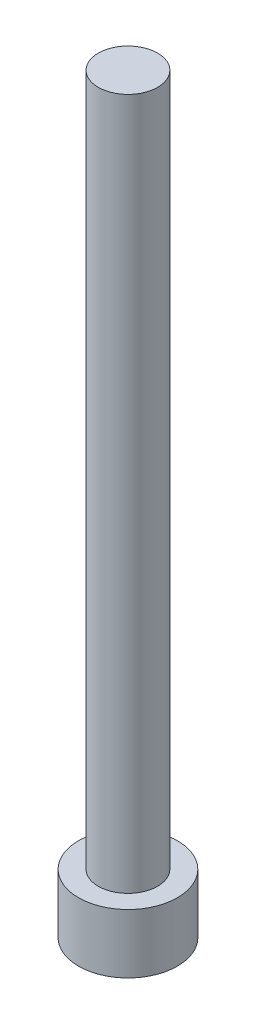
ISO-10303-21;
HEADER;
FILE_DESCRIPTION(('STEP AP214'),'2;1');
FILE_NAME('part.step','',(''),(''),'','','');
FILE_SCHEMA(('AUTOMOTIVE_DESIGN { 1 0 10303 214 1 1 1 1 }'));
ENDSEC;
DATA;
#1=APPLICATION_CONTEXT('core data for automotive mechanical design processes');
#2=APPLICATION_PROTOCOL_DEFINITION('international standard','automotive_design',2000,#1);
#3=PRODUCT_CONTEXT('',#1,'mechanical');
#4=PRODUCT('Part','Part','',(#3));
#5=PRODUCT_RELATED_PRODUCT_CATEGORY('part','',(#4));
#6=PRODUCT_DEFINITION_FORMATION('','',#4);
#7=PRODUCT_DEFINITION_CONTEXT('part definition',#1,'design');
#8=PRODUCT_DEFINITION('design','',#6,#7);
#9=PRODUCT_DEFINITION_SHAPE('','',#8);
#10=(LENGTH_UNIT() NAMED_UNIT(*) SI_UNIT(.MILLI.,.METRE.));
#11=(NAMED_UNIT(*) PLANE_ANGLE_UNIT() SI_UNIT($,.RADIAN.));
#12=(NAMED_UNIT(*) SI_UNIT($,.STERADIAN.) SOLID_ANGLE_UNIT());
#13=UNCERTAINTY_MEASURE_WITH_UNIT(LENGTH_MEASURE(1.E-05),#10,'distance_accuracy_value','');
#14=(GEOMETRIC_REPRESENTATION_CONTEXT(3) GLOBAL_UNCERTAINTY_ASSIGNED_CONTEXT((#13)) GLOBAL_UNIT_ASSIGNED_CONTEXT((#10,
#11,#12)) REPRESENTATION_CONTEXT('',''));
#15=CARTESIAN_POINT('',(0.,0.,0.));
#16=DIRECTION('',(0.,0.,1.));
#17=DIRECTION('',(1.,0.,0.));
#18=AXIS2_PLACEMENT_3D('',#15,#16,#17);
#19=CARTESIAN_POINT('',(0.,3.,0.));
#20=DIRECTION('',(0.,-1.,0.));
#21=DIRECTION('',(0.,0.,-1.));
#22=AXIS2_PLACEMENT_3D('',#19,#20,#21);
#23=CYLINDRICAL_SURFACE('',#22,2.5);
#24=CARTESIAN_POINT('',(0.,3.,0.));
#25=DIRECTION('',(0.,1.,0.));
#26=DIRECTION('',(0.,0.,1.));
#27=AXIS2_PLACEMENT_3D('',#24,#25,#26);
#28=CIRCLE('',#27,2.5);
#29=CARTESIAN_POINT('',(0.,3.,2.5));
#30=VERTEX_POINT('',#29);
#31=EDGE_CURVE('E43',#30,#30,#28,.T.);
#32=ORIENTED_EDGE('',*,*,#31,.F.);
#33=EDGE_LOOP('',(#32));
#34=FACE_BOUND('',#33,.T.);
#35=CARTESIAN_POINT('',(0.,0.,0.));
#36=DIRECTION('',(0.,1.,0.));
#37=DIRECTION('',(0.,0.,1.));
#38=AXIS2_PLACEMENT_3D('',#35,#36,#37);
#39=CIRCLE('',#38,2.5);
#40=CARTESIAN_POINT('',(0.,0.,2.5));
#41=VERTEX_POINT('',#40);
#42=EDGE_CURVE('E38',#41,#41,#39,.T.);
#43=ORIENTED_EDGE('',*,*,#42,.T.);
#44=EDGE_LOOP('',(#43));
#45=FACE_BOUND('',#44,.T.);
#46=ADVANCED_FACE('F35',(#34,#45),#23,.T.);
#47=CARTESIAN_POINT('',(0.,3.,0.));
#48=DIRECTION('',(0.,1.,0.));
#49=DIRECTION('',(0.,0.,1.));
#50=AXIS2_PLACEMENT_3D('',#47,#48,#49);
#51=PLANE('',#50);
#52=CARTESIAN_POINT('',(0.,3.,0.));
#53=DIRECTION('',(0.,1.,0.));
#54=DIRECTION('',(0.,0.,1.));
#55=AXIS2_PLACEMENT_3D('',#52,#53,#54);
#56=CIRCLE('',#55,1.5);
#57=CARTESIAN_POINT('',(0.,3.,1.5));
#58=VERTEX_POINT('',#57);
#59=EDGE_CURVE('E11',#58,#58,#56,.T.);
#60=ORIENTED_EDGE('',*,*,#59,.F.);
#61=EDGE_LOOP('',(#60));
#62=FACE_BOUND('',#61,.T.);
#63=ORIENTED_EDGE('',*,*,#31,.T.);
#64=EDGE_LOOP('',(#63));
#65=FACE_BOUND('',#64,.T.);
#66=ADVANCED_FACE('F155',(#62,#65),#51,.T.);
#67=CARTESIAN_POINT('',(0.,0.,0.));
#68=DIRECTION('',(0.,1.,0.));
#69=DIRECTION('',(0.,0.,1.));
#70=AXIS2_PLACEMENT_3D('',#67,#68,#69);
#71=PLANE('',#70);
#72=DIRECTION('',(-0.5,0.,0.866025403784439));
#73=VECTOR('',#72,1.);
#74=CARTESIAN_POINT('',(1.425,0.,0.));
#75=LINE('',#74,#73);
#76=CARTESIAN_POINT('',(1.425,0.,0.));
#77=VERTEX_POINT('',#76);
#78=CARTESIAN_POINT('',(0.7125,0.,1.23408620039283));
#79=VERTEX_POINT('',#78);
#80=EDGE_CURVE('E125',#77,#79,#75,.T.);
#81=ORIENTED_EDGE('',*,*,#80,.F.);
#82=DIRECTION('',(0.5,0.,0.866025403784439));
#83=VECTOR('',#82,1.);
#84=CARTESIAN_POINT('',(0.7125,0.,-1.23408620039283));
#85=LINE('',#84,#83);
#86=CARTESIAN_POINT('',(0.7125,0.,-1.23408620039283));
#87=VERTEX_POINT('',#86);
#88=EDGE_CURVE('E51',#87,#77,#85,.T.);
#89=ORIENTED_EDGE('',*,*,#88,.F.);
#90=DIRECTION('',(1.,0.,0.));
#91=VECTOR('',#90,1.);
#92=CARTESIAN_POINT('',(-0.7125,0.,-1.23408620039283));
#93=LINE('',#92,#91);
#94=CARTESIAN_POINT('',(-0.7125,0.,-1.23408620039283));
#95=VERTEX_POINT('',#94);
#96=EDGE_CURVE('E134',#95,#87,#93,.T.);
#97=ORIENTED_EDGE('',*,*,#96,.F.);
#98=DIRECTION('',(0.5,0.,-0.866025403784439));
#99=VECTOR('',#98,1.);
#100=CARTESIAN_POINT('',(-1.425,0.,0.));
#101=LINE('',#100,#99);
#102=CARTESIAN_POINT('',(-1.425,0.,0.));
#103=VERTEX_POINT('',#102);
#104=EDGE_CURVE('E132',#103,#95,#101,.T.);
#105=ORIENTED_EDGE('',*,*,#104,.F.);
#106=DIRECTION('',(-0.5,0.,-0.866025403784439));
#107=VECTOR('',#106,1.);
#108=CARTESIAN_POINT('',(-0.7125,0.,1.23408620039283));
#109=LINE('',#108,#107);
#110=CARTESIAN_POINT('',(-0.7125,0.,1.23408620039283));
#111=VERTEX_POINT('',#110);
#112=EDGE_CURVE('E99',#111,#103,#109,.T.);
#113=ORIENTED_EDGE('',*,*,#112,.F.);
#114=DIRECTION('',(-1.,0.,0.));
#115=VECTOR('',#114,1.);
#116=CARTESIAN_POINT('',(0.7125,0.,1.23408620039283));
#117=LINE('',#116,#115);
#118=EDGE_CURVE('E128',#79,#111,#117,.T.);
#119=ORIENTED_EDGE('',*,*,#118,.F.);
#120=EDGE_LOOP('',(#81,#89,#97,#105,#113,#119));
#121=FACE_BOUND('',#120,.T.);
#122=ORIENTED_EDGE('',*,*,#42,.F.);
#123=EDGE_LOOP('',(#122));
#124=FACE_BOUND('',#123,.T.);
#125=ADVANCED_FACE('F152',(#121,#124),#71,.F.);
#126=CARTESIAN_POINT('',(0.,38.,0.));
#127=DIRECTION('',(0.,-1.,0.));
#128=DIRECTION('',(0.,0.,-1.));
#129=AXIS2_PLACEMENT_3D('',#126,#127,#128);
#130=CYLINDRICAL_SURFACE('',#129,1.5);
#131=CARTESIAN_POINT('',(0.,38.,0.));
#132=DIRECTION('',(0.,1.,0.));
#133=DIRECTION('',(0.,0.,1.));
#134=AXIS2_PLACEMENT_3D('',#131,#132,#133);
#135=CIRCLE('',#134,1.5);
#136=CARTESIAN_POINT('',(0.,38.,1.5));
#137=VERTEX_POINT('',#136);
#138=EDGE_CURVE('E138',#137,#137,#135,.T.);
#139=ORIENTED_EDGE('',*,*,#138,.F.);
#140=EDGE_LOOP('',(#139));
#141=FACE_BOUND('',#140,.T.);
#142=ORIENTED_EDGE('',*,*,#59,.T.);
#143=EDGE_LOOP('',(#142));
#144=FACE_BOUND('',#143,.T.);
#145=ADVANCED_FACE('F154',(#141,#144),#130,.T.);
#146=CARTESIAN_POINT('',(0.,38.,0.));
#147=DIRECTION('',(0.,1.,0.));
#148=DIRECTION('',(0.,0.,1.));
#149=AXIS2_PLACEMENT_3D('',#146,#147,#148);
#150=PLANE('',#149);
#151=ORIENTED_EDGE('',*,*,#138,.T.);
#152=EDGE_LOOP('',(#151));
#153=FACE_BOUND('',#152,.T.);
#154=ADVANCED_FACE('F161',(#153),#150,.T.);
#155=CARTESIAN_POINT('',(0.7125,1.65,-1.23408620039283));
#156=DIRECTION('',(0.866025403784439,0.,-0.5));
#157=DIRECTION('',(-0.5,0.,-0.866025403784439));
#158=AXIS2_PLACEMENT_3D('',#155,#156,#157);
#159=PLANE('',#158);
#160=ORIENTED_EDGE('',*,*,#88,.T.);
#161=DIRECTION('',(0.,-1.,0.));
#162=VECTOR('',#161,1.);
#163=CARTESIAN_POINT('',(1.425,1.65,0.));
#164=LINE('',#163,#162);
#165=CARTESIAN_POINT('',(1.425,1.65,0.));
#166=VERTEX_POINT('',#165);
#167=EDGE_CURVE('E81',#166,#77,#164,.T.);
#168=ORIENTED_EDGE('',*,*,#167,.F.);
#169=DIRECTION('',(0.5,0.,0.866025403784439));
#170=VECTOR('',#169,1.);
#171=CARTESIAN_POINT('',(0.7125,1.65,-1.23408620039283));
#172=LINE('',#171,#170);
#173=CARTESIAN_POINT('',(0.7125,1.65,-1.23408620039283));
#174=VERTEX_POINT('',#173);
#175=EDGE_CURVE('E136',#174,#166,#172,.T.);
#176=ORIENTED_EDGE('',*,*,#175,.F.);
#177=DIRECTION('',(0.,-1.,0.));
#178=VECTOR('',#177,1.);
#179=CARTESIAN_POINT('',(0.7125,1.65,-1.23408620039283));
#180=LINE('',#179,#178);
#181=EDGE_CURVE('E59',#174,#87,#180,.T.);
#182=ORIENTED_EDGE('',*,*,#181,.T.);
#183=EDGE_LOOP('',(#160,#168,#176,#182));
#184=FACE_BOUND('',#183,.T.);
#185=ADVANCED_FACE('F190',(#184),#159,.F.);
#186=CARTESIAN_POINT('',(-0.7125,1.65,-1.23408620039283));
#187=DIRECTION('',(0.,0.,-1.));
#188=DIRECTION('',(-1.,0.,0.));
#189=AXIS2_PLACEMENT_3D('',#186,#187,#188);
#190=PLANE('',#189);
#191=ORIENTED_EDGE('',*,*,#96,.T.);
#192=ORIENTED_EDGE('',*,*,#181,.F.);
#193=DIRECTION('',(1.,0.,0.));
#194=VECTOR('',#193,1.);
#195=CARTESIAN_POINT('',(-0.7125,1.65,-1.23408620039283));
#196=LINE('',#195,#194);
#197=CARTESIAN_POINT('',(-0.7125,1.65,-1.23408620039283));
#198=VERTEX_POINT('',#197);
#199=EDGE_CURVE('E111',#198,#174,#196,.T.);
#200=ORIENTED_EDGE('',*,*,#199,.F.);
#201=DIRECTION('',(0.,-1.,0.));
#202=VECTOR('',#201,1.);
#203=CARTESIAN_POINT('',(-0.7125,1.65,-1.23408620039283));
#204=LINE('',#203,#202);
#205=EDGE_CURVE('E103',#198,#95,#204,.T.);
#206=ORIENTED_EDGE('',*,*,#205,.T.);
#207=EDGE_LOOP('',(#191,#192,#200,#206));
#208=FACE_BOUND('',#207,.T.);
#209=ADVANCED_FACE('F204',(#208),#190,.F.);
#210=CARTESIAN_POINT('',(-1.425,1.65,0.));
#211=DIRECTION('',(-0.866025403784439,0.,-0.5));
#212=DIRECTION('',(-0.5,0.,0.866025403784439));
#213=AXIS2_PLACEMENT_3D('',#210,#211,#212);
#214=PLANE('',#213);
#215=ORIENTED_EDGE('',*,*,#104,.T.);
#216=ORIENTED_EDGE('',*,*,#205,.F.);
#217=DIRECTION('',(0.5,0.,-0.866025403784439));
#218=VECTOR('',#217,1.);
#219=CARTESIAN_POINT('',(-1.425,1.65,0.));
#220=LINE('',#219,#218);
#221=CARTESIAN_POINT('',(-1.425,1.65,0.));
#222=VERTEX_POINT('',#221);
#223=EDGE_CURVE('E107',#222,#198,#220,.T.);
#224=ORIENTED_EDGE('',*,*,#223,.F.);
#225=DIRECTION('',(0.,-1.,0.));
#226=VECTOR('',#225,1.);
#227=CARTESIAN_POINT('',(-1.425,1.65,0.));
#228=LINE('',#227,#226);
#229=EDGE_CURVE('E92',#222,#103,#228,.T.);
#230=ORIENTED_EDGE('',*,*,#229,.T.);
#231=EDGE_LOOP('',(#215,#216,#224,#230));
#232=FACE_BOUND('',#231,.T.);
#233=ADVANCED_FACE('F108',(#232),#214,.F.);
#234=CARTESIAN_POINT('',(-0.7125,1.65,1.23408620039283));
#235=DIRECTION('',(-0.866025403784439,0.,0.5));
#236=DIRECTION('',(0.5,0.,0.866025403784439));
#237=AXIS2_PLACEMENT_3D('',#234,#235,#236);
#238=PLANE('',#237);
#239=ORIENTED_EDGE('',*,*,#112,.T.);
#240=ORIENTED_EDGE('',*,*,#229,.F.);
#241=DIRECTION('',(-0.5,0.,-0.866025403784439));
#242=VECTOR('',#241,1.);
#243=CARTESIAN_POINT('',(-0.7125,1.65,1.23408620039283));
#244=LINE('',#243,#242);
#245=CARTESIAN_POINT('',(-0.7125,1.65,1.23408620039283));
#246=VERTEX_POINT('',#245);
#247=EDGE_CURVE('E96',#246,#222,#244,.T.);
#248=ORIENTED_EDGE('',*,*,#247,.F.);
#249=DIRECTION('',(0.,-1.,0.));
#250=VECTOR('',#249,1.);
#251=CARTESIAN_POINT('',(-0.7125,1.65,1.23408620039283));
#252=LINE('',#251,#250);
#253=EDGE_CURVE('E104',#246,#111,#252,.T.);
#254=ORIENTED_EDGE('',*,*,#253,.T.);
#255=EDGE_LOOP('',(#239,#240,#248,#254));
#256=FACE_BOUND('',#255,.T.);
#257=ADVANCED_FACE('F94',(#256),#238,.F.);
#258=CARTESIAN_POINT('',(0.7125,1.65,1.23408620039283));
#259=DIRECTION('',(0.,0.,1.));
#260=DIRECTION('',(1.,0.,0.));
#261=AXIS2_PLACEMENT_3D('',#258,#259,#260);
#262=PLANE('',#261);
#263=ORIENTED_EDGE('',*,*,#118,.T.);
#264=ORIENTED_EDGE('',*,*,#253,.F.);
#265=DIRECTION('',(-1.,0.,0.));
#266=VECTOR('',#265,1.);
#267=CARTESIAN_POINT('',(0.7125,1.65,1.23408620039283));
#268=LINE('',#267,#266);
#269=CARTESIAN_POINT('',(0.7125,1.65,1.23408620039283));
#270=VERTEX_POINT('',#269);
#271=EDGE_CURVE('E117',#270,#246,#268,.T.);
#272=ORIENTED_EDGE('',*,*,#271,.F.);
#273=DIRECTION('',(0.,-1.,0.));
#274=VECTOR('',#273,1.);
#275=CARTESIAN_POINT('',(0.7125,1.65,1.23408620039283));
#276=LINE('',#275,#274);
#277=EDGE_CURVE('E141',#270,#79,#276,.T.);
#278=ORIENTED_EDGE('',*,*,#277,.T.);
#279=EDGE_LOOP('',(#263,#264,#272,#278));
#280=FACE_BOUND('',#279,.T.);
#281=ADVANCED_FACE('F229',(#280),#262,.F.);
#282=CARTESIAN_POINT('',(1.425,1.65,0.));
#283=DIRECTION('',(0.866025403784439,0.,0.5));
#284=DIRECTION('',(0.5,0.,-0.866025403784438));
#285=AXIS2_PLACEMENT_3D('',#282,#283,#284);
#286=PLANE('',#285);
#287=ORIENTED_EDGE('',*,*,#80,.T.);
#288=ORIENTED_EDGE('',*,*,#277,.F.);
#289=DIRECTION('',(-0.5,0.,0.866025403784439));
#290=VECTOR('',#289,1.);
#291=CARTESIAN_POINT('',(1.425,1.65,0.));
#292=LINE('',#291,#290);
#293=EDGE_CURVE('E119',#166,#270,#292,.T.);
#294=ORIENTED_EDGE('',*,*,#293,.F.);
#295=ORIENTED_EDGE('',*,*,#167,.T.);
#296=EDGE_LOOP('',(#287,#288,#294,#295));
#297=FACE_BOUND('',#296,.T.);
#298=ADVANCED_FACE('F238',(#297),#286,.F.);
#299=CARTESIAN_POINT('',(0.,1.65,0.));
#300=DIRECTION('',(0.,-1.,0.));
#301=DIRECTION('',(0.,0.,-1.));
#302=AXIS2_PLACEMENT_3D('',#299,#300,#301);
#303=PLANE('',#302);
#304=ORIENTED_EDGE('',*,*,#175,.T.);
#305=ORIENTED_EDGE('',*,*,#293,.T.);
#306=ORIENTED_EDGE('',*,*,#271,.T.);
#307=ORIENTED_EDGE('',*,*,#247,.T.);
#308=ORIENTED_EDGE('',*,*,#223,.T.);
#309=ORIENTED_EDGE('',*,*,#199,.T.);
#310=EDGE_LOOP('',(#304,#305,#306,#307,#308,#309));
#311=FACE_BOUND('',#310,.T.);
#312=ADVANCED_FACE('F114',(#311),#303,.T.);
#313=CLOSED_SHELL('',(#46,#66,#125,#145,#154,#185,#209,#233,#257,#281,#298,#312));
#314=MANIFOLD_SOLID_BREP('B2',#313);
#315=ADVANCED_BREP_SHAPE_REPRESENTATION('',(#18,#314),#14);
#316=SHAPE_DEFINITION_REPRESENTATION(#9,#315);
ENDSEC;
END-ISO-10303-21;
